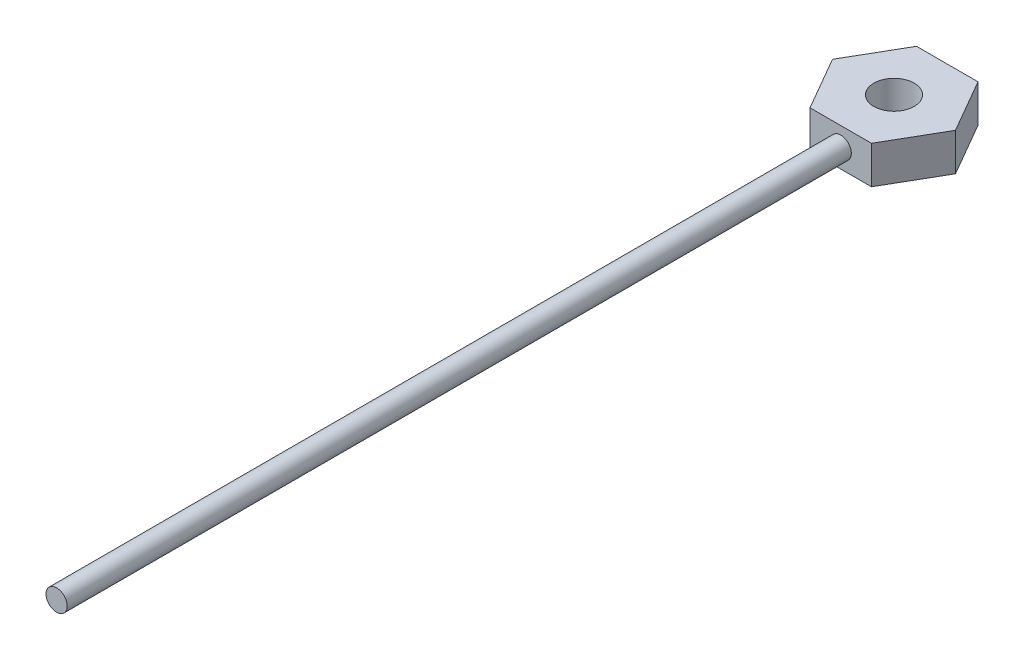
ISO-10303-21;
HEADER;
FILE_DESCRIPTION(('STEP AP214'),'2;1');
FILE_NAME('part.step','',(''),(''),'','','');
FILE_SCHEMA(('AUTOMOTIVE_DESIGN { 1 0 10303 214 1 1 1 1 }'));
ENDSEC;
DATA;
#1=APPLICATION_CONTEXT('core data for automotive mechanical design processes');
#2=APPLICATION_PROTOCOL_DEFINITION('international standard','automotive_design',2000,#1);
#3=PRODUCT_CONTEXT('',#1,'mechanical');
#4=PRODUCT('Part','Part','',(#3));
#5=PRODUCT_RELATED_PRODUCT_CATEGORY('part','',(#4));
#6=PRODUCT_DEFINITION_FORMATION('','',#4);
#7=PRODUCT_DEFINITION_CONTEXT('part definition',#1,'design');
#8=PRODUCT_DEFINITION('design','',#6,#7);
#9=PRODUCT_DEFINITION_SHAPE('','',#8);
#10=(LENGTH_UNIT() NAMED_UNIT(*) SI_UNIT(.MILLI.,.METRE.));
#11=(NAMED_UNIT(*) PLANE_ANGLE_UNIT() SI_UNIT($,.RADIAN.));
#12=(NAMED_UNIT(*) SI_UNIT($,.STERADIAN.) SOLID_ANGLE_UNIT());
#13=UNCERTAINTY_MEASURE_WITH_UNIT(LENGTH_MEASURE(1.E-05),#10,'distance_accuracy_value','');
#14=(GEOMETRIC_REPRESENTATION_CONTEXT(3) GLOBAL_UNCERTAINTY_ASSIGNED_CONTEXT((#13)) GLOBAL_UNIT_ASSIGNED_CONTEXT((#10,
#11,#12)) REPRESENTATION_CONTEXT('',''));
#15=CARTESIAN_POINT('',(0.,0.,0.));
#16=DIRECTION('',(0.,0.,1.));
#17=DIRECTION('',(1.,0.,0.));
#18=AXIS2_PLACEMENT_3D('',#15,#16,#17);
#19=CARTESIAN_POINT('',(-7.34335154011448,9.,12.7190579653177));
#20=DIRECTION('',(0.,0.,-1.));
#21=DIRECTION('',(-1.,0.,0.));
#22=AXIS2_PLACEMENT_3D('',#19,#20,#21);
#23=PLANE('',#22);
#24=DIRECTION('',(1.,0.,0.));
#25=VECTOR('',#24,1.);
#26=CARTESIAN_POINT('',(-7.34335154011448,0.,12.7190579653177));
#27=LINE('',#26,#25);
#28=CARTESIAN_POINT('',(-7.34335154011448,0.,12.7190579653177));
#29=VERTEX_POINT('',#28);
#30=CARTESIAN_POINT('',(7.34335154011475,0.,12.7190579653176));
#31=VERTEX_POINT('',#30);
#32=EDGE_CURVE('E80',#29,#31,#27,.T.);
#33=ORIENTED_EDGE('',*,*,#32,.T.);
#34=DIRECTION('',(0.,-1.,0.));
#35=VECTOR('',#34,1.);
#36=CARTESIAN_POINT('',(7.34335154011475,9.,12.7190579653176));
#37=LINE('',#36,#35);
#38=CARTESIAN_POINT('',(7.34335154011475,9.,12.7190579653176));
#39=VERTEX_POINT('',#38);
#40=EDGE_CURVE('E117',#39,#31,#37,.T.);
#41=ORIENTED_EDGE('',*,*,#40,.F.);
#42=DIRECTION('',(1.,0.,0.));
#43=VECTOR('',#42,1.);
#44=CARTESIAN_POINT('',(-7.34335154011448,9.,12.7190579653177));
#45=LINE('',#44,#43);
#46=CARTESIAN_POINT('',(-7.34335154011448,9.,12.7190579653177));
#47=VERTEX_POINT('',#46);
#48=EDGE_CURVE('E51',#47,#39,#45,.T.);
#49=ORIENTED_EDGE('',*,*,#48,.F.);
#50=DIRECTION('',(0.,-1.,0.));
#51=VECTOR('',#50,1.);
#52=CARTESIAN_POINT('',(-7.34335154011448,9.,12.7190579653177));
#53=LINE('',#52,#51);
#54=EDGE_CURVE('E113',#47,#29,#53,.T.);
#55=ORIENTED_EDGE('',*,*,#54,.T.);
#56=EDGE_LOOP('',(#33,#41,#49,#55));
#57=FACE_BOUND('',#56,.T.);
#58=CARTESIAN_POINT('',(0.,4.5,12.7190579653176));
#59=DIRECTION('',(0.,0.,-1.));
#60=DIRECTION('',(-1.,0.,0.));
#61=AXIS2_PLACEMENT_3D('',#58,#59,#60);
#62=CIRCLE('',#61,2.53);
#63=CARTESIAN_POINT('',(-2.53,4.5,12.7190579653177));
#64=VERTEX_POINT('',#63);
#65=EDGE_CURVE('E11',#64,#64,#62,.F.);
#66=ORIENTED_EDGE('',*,*,#65,.F.);
#67=EDGE_LOOP('',(#66));
#68=FACE_BOUND('',#67,.T.);
#69=ADVANCED_FACE('F33',(#57,#68),#23,.F.);
#70=CARTESIAN_POINT('',(0.,9.,0.));
#71=DIRECTION('',(0.,-1.,0.));
#72=DIRECTION('',(0.,0.,-1.));
#73=AXIS2_PLACEMENT_3D('',#70,#71,#72);
#74=CYLINDRICAL_SURFACE('',#73,4.825);
#75=CARTESIAN_POINT('',(0.,0.,0.));
#76=DIRECTION('',(0.,1.,0.));
#77=DIRECTION('',(0.,0.,1.));
#78=AXIS2_PLACEMENT_3D('',#75,#76,#77);
#79=CIRCLE('',#78,4.825);
#80=CARTESIAN_POINT('',(0.,0.,4.825));
#81=VERTEX_POINT('',#80);
#82=EDGE_CURVE('E151',#81,#81,#79,.T.);
#83=ORIENTED_EDGE('',*,*,#82,.F.);
#84=EDGE_LOOP('',(#83));
#85=FACE_BOUND('',#84,.T.);
#86=CARTESIAN_POINT('',(0.,9.,0.));
#87=DIRECTION('',(0.,1.,0.));
#88=DIRECTION('',(0.,0.,1.));
#89=AXIS2_PLACEMENT_3D('',#86,#87,#88);
#90=CIRCLE('',#89,4.825);
#91=CARTESIAN_POINT('',(0.,9.,4.825));
#92=VERTEX_POINT('',#91);
#93=EDGE_CURVE('E125',#92,#92,#90,.T.);
#94=ORIENTED_EDGE('',*,*,#93,.T.);
#95=EDGE_LOOP('',(#94));
#96=FACE_BOUND('',#95,.T.);
#97=ADVANCED_FACE('F169',(#85,#96),#74,.F.);
#98=CARTESIAN_POINT('',(0.,9.,0.));
#99=DIRECTION('',(0.,1.,0.));
#100=DIRECTION('',(0.,0.,1.));
#101=AXIS2_PLACEMENT_3D('',#98,#99,#100);
#102=PLANE('',#101);
#103=DIRECTION('',(0.499999999999995,0.,-0.866025403784441));
#104=VECTOR('',#103,1.);
#105=CARTESIAN_POINT('',(7.34335154011475,9.,12.7190579653176));
#106=LINE('',#105,#104);
#107=CARTESIAN_POINT('',(14.6867030802292,9.,0.));
#108=VERTEX_POINT('',#107);
#109=EDGE_CURVE('E132',#39,#108,#106,.T.);
#110=ORIENTED_EDGE('',*,*,#109,.T.);
#111=DIRECTION('',(-0.500000000000001,0.,-0.866025403784438));
#112=VECTOR('',#111,1.);
#113=CARTESIAN_POINT('',(14.6867030802292,9.,0.));
#114=LINE('',#113,#112);
#115=CARTESIAN_POINT('',(7.34335154011457,9.,-12.7190579653177));
#116=VERTEX_POINT('',#115);
#117=EDGE_CURVE('E89',#108,#116,#114,.T.);
#118=ORIENTED_EDGE('',*,*,#117,.T.);
#119=DIRECTION('',(-1.,0.,0.));
#120=VECTOR('',#119,1.);
#121=CARTESIAN_POINT('',(7.34335154011457,9.,-12.7190579653177));
#122=LINE('',#121,#120);
#123=CARTESIAN_POINT('',(-7.34335154011466,9.,-12.7190579653176));
#124=VERTEX_POINT('',#123);
#125=EDGE_CURVE('E103',#116,#124,#122,.T.);
#126=ORIENTED_EDGE('',*,*,#125,.T.);
#127=DIRECTION('',(-0.499999999999995,0.,0.866025403784442));
#128=VECTOR('',#127,1.);
#129=CARTESIAN_POINT('',(-7.34335154011466,9.,-12.7190579653176));
#130=LINE('',#129,#128);
#131=CARTESIAN_POINT('',(-14.6867030802292,9.,1.02556758868348E-13));
#132=VERTEX_POINT('',#131);
#133=EDGE_CURVE('E96',#124,#132,#130,.T.);
#134=ORIENTED_EDGE('',*,*,#133,.T.);
#135=DIRECTION('',(0.500000000000007,0.,0.866025403784434));
#136=VECTOR('',#135,1.);
#137=CARTESIAN_POINT('',(-14.6867030802292,9.,1.02556758868348E-13));
#138=LINE('',#137,#136);
#139=EDGE_CURVE('E101',#132,#47,#138,.T.);
#140=ORIENTED_EDGE('',*,*,#139,.T.);
#141=ORIENTED_EDGE('',*,*,#48,.T.);
#142=EDGE_LOOP('',(#110,#118,#126,#134,#140,#141));
#143=FACE_BOUND('',#142,.T.);
#144=ORIENTED_EDGE('',*,*,#93,.F.);
#145=EDGE_LOOP('',(#144));
#146=FACE_BOUND('',#145,.T.);
#147=ADVANCED_FACE('F98',(#143,#146),#102,.T.);
#148=CARTESIAN_POINT('',(0.,0.,0.));
#149=DIRECTION('',(0.,1.,0.));
#150=DIRECTION('',(0.,0.,1.));
#151=AXIS2_PLACEMENT_3D('',#148,#149,#150);
#152=PLANE('',#151);
#153=DIRECTION('',(0.499999999999995,0.,-0.866025403784441));
#154=VECTOR('',#153,1.);
#155=CARTESIAN_POINT('',(7.34335154011475,0.,12.7190579653176));
#156=LINE('',#155,#154);
#157=CARTESIAN_POINT('',(14.6867030802292,0.,0.));
#158=VERTEX_POINT('',#157);
#159=EDGE_CURVE('E121',#31,#158,#156,.T.);
#160=ORIENTED_EDGE('',*,*,#159,.F.);
#161=ORIENTED_EDGE('',*,*,#32,.F.);
#162=DIRECTION('',(0.500000000000007,0.,0.866025403784434));
#163=VECTOR('',#162,1.);
#164=CARTESIAN_POINT('',(-14.6867030802292,0.,1.02556758868348E-13));
#165=LINE('',#164,#163);
#166=CARTESIAN_POINT('',(-14.6867030802292,0.,1.02556758868348E-13));
#167=VERTEX_POINT('',#166);
#168=EDGE_CURVE('E74',#167,#29,#165,.T.);
#169=ORIENTED_EDGE('',*,*,#168,.F.);
#170=DIRECTION('',(-0.499999999999995,0.,0.866025403784442));
#171=VECTOR('',#170,1.);
#172=CARTESIAN_POINT('',(-7.34335154011466,0.,-12.7190579653176));
#173=LINE('',#172,#171);
#174=CARTESIAN_POINT('',(-7.34335154011466,0.,-12.7190579653176));
#175=VERTEX_POINT('',#174);
#176=EDGE_CURVE('E111',#175,#167,#173,.T.);
#177=ORIENTED_EDGE('',*,*,#176,.F.);
#178=DIRECTION('',(-1.,0.,0.));
#179=VECTOR('',#178,1.);
#180=CARTESIAN_POINT('',(7.34335154011457,0.,-12.7190579653177));
#181=LINE('',#180,#179);
#182=CARTESIAN_POINT('',(7.34335154011457,0.,-12.7190579653177));
#183=VERTEX_POINT('',#182);
#184=EDGE_CURVE('E127',#183,#175,#181,.T.);
#185=ORIENTED_EDGE('',*,*,#184,.F.);
#186=DIRECTION('',(-0.500000000000001,0.,-0.866025403784438));
#187=VECTOR('',#186,1.);
#188=CARTESIAN_POINT('',(14.6867030802292,0.,0.));
#189=LINE('',#188,#187);
#190=EDGE_CURVE('E124',#158,#183,#189,.T.);
#191=ORIENTED_EDGE('',*,*,#190,.F.);
#192=EDGE_LOOP('',(#160,#161,#169,#177,#185,#191));
#193=FACE_BOUND('',#192,.T.);
#194=ORIENTED_EDGE('',*,*,#82,.T.);
#195=EDGE_LOOP('',(#194));
#196=FACE_BOUND('',#195,.T.);
#197=ADVANCED_FACE('F145',(#193,#196),#152,.F.);
#198=CARTESIAN_POINT('',(7.34335154011475,9.,12.7190579653176));
#199=DIRECTION('',(-0.866025403784442,0.,-0.499999999999995));
#200=DIRECTION('',(-0.499999999999995,0.,0.866025403784442));
#201=AXIS2_PLACEMENT_3D('',#198,#199,#200);
#202=PLANE('',#201);
#203=ORIENTED_EDGE('',*,*,#159,.T.);
#204=DIRECTION('',(0.,-1.,0.));
#205=VECTOR('',#204,1.);
#206=CARTESIAN_POINT('',(14.6867030802292,9.,0.));
#207=LINE('',#206,#205);
#208=EDGE_CURVE('E37',#108,#158,#207,.T.);
#209=ORIENTED_EDGE('',*,*,#208,.F.);
#210=ORIENTED_EDGE('',*,*,#109,.F.);
#211=ORIENTED_EDGE('',*,*,#40,.T.);
#212=EDGE_LOOP('',(#203,#209,#210,#211));
#213=FACE_BOUND('',#212,.T.);
#214=ADVANCED_FACE('F35',(#213),#202,.F.);
#215=CARTESIAN_POINT('',(14.6867030802292,9.,0.));
#216=DIRECTION('',(-0.866025403784438,0.,0.500000000000001));
#217=DIRECTION('',(0.500000000000001,0.,0.866025403784438));
#218=AXIS2_PLACEMENT_3D('',#215,#216,#217);
#219=PLANE('',#218);
#220=ORIENTED_EDGE('',*,*,#190,.T.);
#221=DIRECTION('',(0.,-1.,0.));
#222=VECTOR('',#221,1.);
#223=CARTESIAN_POINT('',(7.34335154011457,9.,-12.7190579653177));
#224=LINE('',#223,#222);
#225=EDGE_CURVE('E135',#116,#183,#224,.T.);
#226=ORIENTED_EDGE('',*,*,#225,.F.);
#227=ORIENTED_EDGE('',*,*,#117,.F.);
#228=ORIENTED_EDGE('',*,*,#208,.T.);
#229=EDGE_LOOP('',(#220,#226,#227,#228));
#230=FACE_BOUND('',#229,.T.);
#231=ADVANCED_FACE('F140',(#230),#219,.F.);
#232=CARTESIAN_POINT('',(7.34335154011457,9.,-12.7190579653177));
#233=DIRECTION('',(0.,0.,1.));
#234=DIRECTION('',(1.,0.,0.));
#235=AXIS2_PLACEMENT_3D('',#232,#233,#234);
#236=PLANE('',#235);
#237=ORIENTED_EDGE('',*,*,#184,.T.);
#238=DIRECTION('',(0.,-1.,0.));
#239=VECTOR('',#238,1.);
#240=CARTESIAN_POINT('',(-7.34335154011466,9.,-12.7190579653176));
#241=LINE('',#240,#239);
#242=EDGE_CURVE('E112',#124,#175,#241,.T.);
#243=ORIENTED_EDGE('',*,*,#242,.F.);
#244=ORIENTED_EDGE('',*,*,#125,.F.);
#245=ORIENTED_EDGE('',*,*,#225,.T.);
#246=EDGE_LOOP('',(#237,#243,#244,#245));
#247=FACE_BOUND('',#246,.T.);
#248=ADVANCED_FACE('F147',(#247),#236,.F.);
#249=CARTESIAN_POINT('',(-7.34335154011466,9.,-12.7190579653176));
#250=DIRECTION('',(0.866025403784442,0.,0.499999999999995));
#251=DIRECTION('',(0.499999999999995,0.,-0.866025403784442));
#252=AXIS2_PLACEMENT_3D('',#249,#250,#251);
#253=PLANE('',#252);
#254=ORIENTED_EDGE('',*,*,#176,.T.);
#255=DIRECTION('',(0.,-1.,0.));
#256=VECTOR('',#255,1.);
#257=CARTESIAN_POINT('',(-14.6867030802292,9.,1.02556758868348E-13));
#258=LINE('',#257,#256);
#259=EDGE_CURVE('E108',#132,#167,#258,.T.);
#260=ORIENTED_EDGE('',*,*,#259,.F.);
#261=ORIENTED_EDGE('',*,*,#133,.F.);
#262=ORIENTED_EDGE('',*,*,#242,.T.);
#263=EDGE_LOOP('',(#254,#260,#261,#262));
#264=FACE_BOUND('',#263,.T.);
#265=ADVANCED_FACE('F109',(#264),#253,.F.);
#266=CARTESIAN_POINT('',(-14.6867030802292,9.,1.02556758868348E-13));
#267=DIRECTION('',(0.866025403784434,0.,-0.500000000000007));
#268=DIRECTION('',(-0.500000000000007,0.,-0.866025403784435));
#269=AXIS2_PLACEMENT_3D('',#266,#267,#268);
#270=PLANE('',#269);
#271=ORIENTED_EDGE('',*,*,#168,.T.);
#272=ORIENTED_EDGE('',*,*,#54,.F.);
#273=ORIENTED_EDGE('',*,*,#139,.F.);
#274=ORIENTED_EDGE('',*,*,#259,.T.);
#275=EDGE_LOOP('',(#271,#272,#273,#274));
#276=FACE_BOUND('',#275,.T.);
#277=ADVANCED_FACE('F115',(#276),#270,.F.);
#278=CARTESIAN_POINT('',(0.,4.5,200.));
#279=DIRECTION('',(0.,0.,-1.));
#280=DIRECTION('',(-1.,0.,0.));
#281=AXIS2_PLACEMENT_3D('',#278,#279,#280);
#282=CYLINDRICAL_SURFACE('',#281,2.53);
#283=CARTESIAN_POINT('',(0.,4.5,200.));
#284=DIRECTION('',(0.,0.,1.));
#285=DIRECTION('',(1.,0.,0.));
#286=AXIS2_PLACEMENT_3D('',#283,#284,#285);
#287=CIRCLE('',#286,2.53);
#288=CARTESIAN_POINT('',(2.53,4.5,200.));
#289=VERTEX_POINT('',#288);
#290=EDGE_CURVE('E154',#289,#289,#287,.T.);
#291=ORIENTED_EDGE('',*,*,#290,.F.);
#292=EDGE_LOOP('',(#291));
#293=FACE_BOUND('',#292,.T.);
#294=ORIENTED_EDGE('',*,*,#65,.T.);
#295=EDGE_LOOP('',(#294));
#296=FACE_BOUND('',#295,.T.);
#297=ADVANCED_FACE('F162',(#293,#296),#282,.T.);
#298=CARTESIAN_POINT('',(0.,4.5,200.));
#299=DIRECTION('',(0.,0.,1.));
#300=DIRECTION('',(1.,0.,0.));
#301=AXIS2_PLACEMENT_3D('',#298,#299,#300);
#302=PLANE('',#301);
#303=ORIENTED_EDGE('',*,*,#290,.T.);
#304=EDGE_LOOP('',(#303));
#305=FACE_BOUND('',#304,.T.);
#306=ADVANCED_FACE('F160',(#305),#302,.T.);
#307=CLOSED_SHELL('',(#69,#97,#147,#197,#214,#231,#248,#265,#277,#297,#306));
#308=MANIFOLD_SOLID_BREP('B2',#307);
#309=ADVANCED_BREP_SHAPE_REPRESENTATION('',(#18,#308),#14);
#310=SHAPE_DEFINITION_REPRESENTATION(#9,#309);
ENDSEC;
END-ISO-10303-21;
